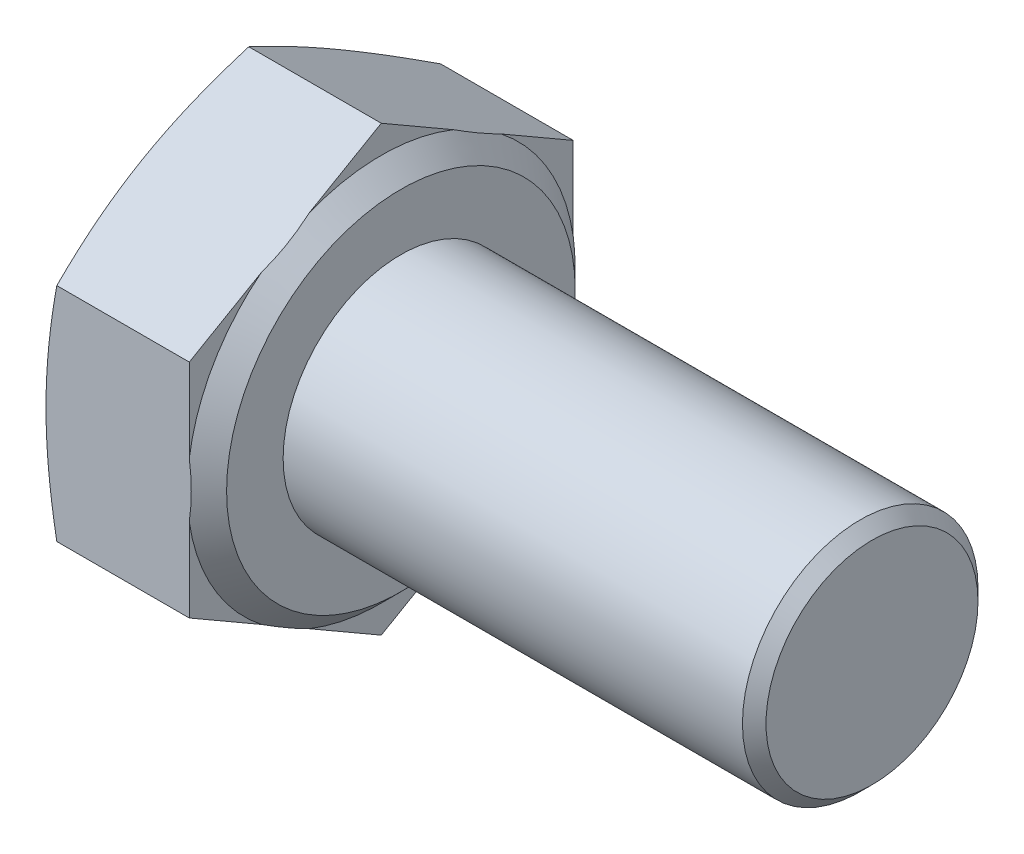
ISO-10303-21;
HEADER;
FILE_DESCRIPTION(('STEP AP214'),'2;1');
FILE_NAME('part.step','',(''),(''),'','','');
FILE_SCHEMA(('AUTOMOTIVE_DESIGN { 1 0 10303 214 1 1 1 1 }'));
ENDSEC;
DATA;
#1=APPLICATION_CONTEXT('core data for automotive mechanical design processes');
#2=APPLICATION_PROTOCOL_DEFINITION('international standard','automotive_design',2000,#1);
#3=PRODUCT_CONTEXT('',#1,'mechanical');
#4=PRODUCT('Part','Part','',(#3));
#5=PRODUCT_RELATED_PRODUCT_CATEGORY('part','',(#4));
#6=PRODUCT_DEFINITION_FORMATION('','',#4);
#7=PRODUCT_DEFINITION_CONTEXT('part definition',#1,'design');
#8=PRODUCT_DEFINITION('design','',#6,#7);
#9=PRODUCT_DEFINITION_SHAPE('','',#8);
#10=(LENGTH_UNIT() NAMED_UNIT(*) SI_UNIT(.MILLI.,.METRE.));
#11=(NAMED_UNIT(*) PLANE_ANGLE_UNIT() SI_UNIT($,.RADIAN.));
#12=(NAMED_UNIT(*) SI_UNIT($,.STERADIAN.) SOLID_ANGLE_UNIT());
#13=UNCERTAINTY_MEASURE_WITH_UNIT(LENGTH_MEASURE(1.E-05),#10,'distance_accuracy_value','');
#14=(GEOMETRIC_REPRESENTATION_CONTEXT(3) GLOBAL_UNCERTAINTY_ASSIGNED_CONTEXT((#13)) GLOBAL_UNIT_ASSIGNED_CONTEXT((#10,
#11,#12)) REPRESENTATION_CONTEXT('',''));
#15=CARTESIAN_POINT('',(0.,0.,0.));
#16=DIRECTION('',(0.,0.,1.));
#17=DIRECTION('',(1.,0.,0.));
#18=AXIS2_PLACEMENT_3D('',#15,#16,#17);
#19=CARTESIAN_POINT('',(4.15,-8.46972844901181,4.89));
#20=DIRECTION('',(-1.,0.,0.));
#21=DIRECTION('',(0.,0.,1.));
#22=AXIS2_PLACEMENT_3D('',#19,#20,#21);
#23=PLANE('',#22);
#24=CARTESIAN_POINT('',(4.15,0.,0.));
#25=DIRECTION('',(-1.,0.,0.));
#26=DIRECTION('',(0.,0.,1.));
#27=AXIS2_PLACEMENT_3D('',#24,#25,#26);
#28=CIRCLE('',#27,4.44);
#29=CARTESIAN_POINT('',(4.15,0.,4.44));
#30=VERTEX_POINT('',#29);
#31=EDGE_CURVE('E507',#30,#30,#28,.T.);
#32=ORIENTED_EDGE('',*,*,#31,.F.);
#33=EDGE_LOOP('',(#32));
#34=FACE_BOUND('',#33,.T.);
#35=CARTESIAN_POINT('',(4.15,0.,0.));
#36=DIRECTION('',(-1.,0.,0.));
#37=DIRECTION('',(0.,0.,1.));
#38=AXIS2_PLACEMENT_3D('',#35,#36,#37);
#39=CIRCLE('',#38,3.);
#40=CARTESIAN_POINT('',(4.15,0.,3.));
#41=VERTEX_POINT('',#40);
#42=EDGE_CURVE('E190',#41,#41,#39,.F.);
#43=ORIENTED_EDGE('',*,*,#42,.F.);
#44=EDGE_LOOP('',(#43));
#45=FACE_BOUND('',#44,.T.);
#46=ADVANCED_FACE('F37',(#34,#45),#23,.F.);
#47=CARTESIAN_POINT('',(4.15,-5.64648563267454,0.));
#48=DIRECTION('',(0.,0.866025403784439,0.5));
#49=DIRECTION('',(0.,-0.5,0.866025403784439));
#50=AXIS2_PLACEMENT_3D('',#47,#48,#49);
#51=PLANE('',#50);
#52=CARTESIAN_POINT('',(0.275380281895275,-2.82312734628344,-4.8902));
#53=CARTESIAN_POINT('',(0.232806027313739,-2.94005354571479,-4.68767788184897));
#54=CARTESIAN_POINT('',(0.194077322500995,-3.05736532610898,-4.48448791787986));
#55=CARTESIAN_POINT('',(0.125940094634839,-3.29275168688454,-4.07678678160786));
#56=CARTESIAN_POINT('',(0.0965388652659339,-3.4108267909009,-3.87227470234254));
#57=CARTESIAN_POINT('',(0.0489831961065203,-3.64642938860636,-3.46419903272147));
#58=CARTESIAN_POINT('',(0.0307250265266,-3.76395150127031,-3.26064476257468));
#59=CARTESIAN_POINT('',(0.0062356835414141,-3.99927056390381,-2.85306019010397));
#60=CARTESIAN_POINT('',(0.,-4.11706739420486,-2.64903009505199));
#61=CARTESIAN_POINT('',(0.,-4.35266105480696,-2.24096990494801));
#62=CARTESIAN_POINT('',(0.0062356835414142,-4.47045788510801,-2.03693980989603));
#63=CARTESIAN_POINT('',(0.0307250265266002,-4.70577694774151,-1.62935523742532));
#64=CARTESIAN_POINT('',(0.0489831961065208,-4.82329906040546,-1.42580096727852));
#65=CARTESIAN_POINT('',(0.0965388652659345,-5.05890165811091,-1.01772529765746));
#66=CARTESIAN_POINT('',(0.12594009463484,-5.17697676212728,-0.81321321839214));
#67=CARTESIAN_POINT('',(0.194077322500995,-5.41236312290283,-0.40551208212014));
#68=CARTESIAN_POINT('',(0.232806027313739,-5.52967490329703,-0.202322118151032));
#69=CARTESIAN_POINT('',(0.275380281895276,-5.64660110272838,0.000200000000001797));
#70=B_SPLINE_CURVE_WITH_KNOTS('',3,(#52,#53,#54,#55,#56,#57,#58,#59,#60,#61,#62,#63,#64,#65,#66,
#67,#68,#69),.UNSPECIFIED.,.F.,.F.,(4,2,2,2,2,2,2,2,4),(0.,0.713162340175091,1.42688097587953,
2.13385008160519,2.84055392207798,3.54725776255078,4.25422686827643,4.96794550398088,
5.68110784415597),.UNSPECIFIED.);
#71=CARTESIAN_POINT('',(0.275338252943565,-2.82324281633728,-4.89));
#72=VERTEX_POINT('',#71);
#73=CARTESIAN_POINT('',(0.,-4.2348642245059,-2.445));
#74=VERTEX_POINT('',#73);
#75=EDGE_CURVE('E152',#72,#74,#70,.T.);
#76=ORIENTED_EDGE('',*,*,#75,.F.);
#77=DIRECTION('',(-1.,0.,0.));
#78=VECTOR('',#77,1.);
#79=CARTESIAN_POINT('',(4.15,-2.82324281633727,-4.89));
#80=LINE('',#79,#78);
#81=CARTESIAN_POINT('',(3.65,-2.82324281633728,-4.89));
#82=VERTEX_POINT('',#81);
#83=EDGE_CURVE('E181',#82,#72,#80,.T.);
#84=ORIENTED_EDGE('',*,*,#83,.F.);
#85=DIRECTION('',(0.,0.5,-0.866025403784439));
#86=VECTOR('',#85,1.);
#87=CARTESIAN_POINT('',(3.65,-5.64648563267454,0.));
#88=LINE('',#87,#86);
#89=CARTESIAN_POINT('',(3.65,-3.88432891957927,-3.05214495797958));
#90=VERTEX_POINT('',#89);
#91=EDGE_CURVE('E311',#90,#82,#88,.T.);
#92=ORIENTED_EDGE('',*,*,#91,.F.);
#93=CARTESIAN_POINT('',(3.6498,-4.58610347345171,-1.83663577521354));
#94=CARTESIAN_POINT('',(3.66642630233643,-4.52781095860012,-1.93760137263744));
#95=CARTESIAN_POINT('',(3.67899788281248,-4.46922077375916,-2.03908254960684));
#96=CARTESIAN_POINT('',(3.69576369124272,-4.35204080140414,-2.24204421535525));
#97=CARTESIAN_POINT('',(3.7000000000002,-4.29345251295301,-2.34352210768111));
#98=CARTESIAN_POINT('',(3.69999999999981,-4.17627593605075,-2.54647789233283));
#99=CARTESIAN_POINT('',(3.69576369124194,-4.11768764759962,-2.64795578465868));
#100=CARTESIAN_POINT('',(3.67899788281095,-4.00050767524463,-2.85091745040704));
#101=CARTESIAN_POINT('',(3.66642630233452,-3.94191749040369,-2.9523986273764));
#102=CARTESIAN_POINT('',(3.64979999999773,-3.88362497555213,-3.05336422480026));
#103=B_SPLINE_CURVE_WITH_KNOTS('',3,(#93,#94,#95,#96,#97,#98,#99,#100,#101,#102),.UNSPECIFIED.,
.F.,.F.,(4,2,2,2,4),(0.,0.353249681620497,0.704711351351652,1.05617302108281,1.4094227027033),.UNSPECIFIED.);
#104=CARTESIAN_POINT('',(3.65,-4.58539952943254,-1.83785504202042));
#105=VERTEX_POINT('',#104);
#106=EDGE_CURVE('E298',#105,#90,#103,.T.);
#107=ORIENTED_EDGE('',*,*,#106,.F.);
#108=CARTESIAN_POINT('',(3.65,-5.64648563267454,0.));
#109=VERTEX_POINT('',#108);
#110=EDGE_CURVE('E308',#109,#105,#88,.T.);
#111=ORIENTED_EDGE('',*,*,#110,.F.);
#112=DIRECTION('',(-1.,0.,0.));
#113=VECTOR('',#112,1.);
#114=CARTESIAN_POINT('',(4.15,-5.64648563267454,0.));
#115=LINE('',#114,#113);
#116=CARTESIAN_POINT('',(0.275338252943565,-5.64648563267454,0.));
#117=VERTEX_POINT('',#116);
#118=EDGE_CURVE('E175',#109,#117,#115,.T.);
#119=ORIENTED_EDGE('',*,*,#118,.T.);
#120=EDGE_CURVE('E265',#74,#117,#70,.T.);
#121=ORIENTED_EDGE('',*,*,#120,.F.);
#122=EDGE_LOOP('',(#76,#84,#92,#107,#111,#119,#121));
#123=FACE_BOUND('',#122,.T.);
#124=ADVANCED_FACE('F206',(#123),#51,.F.);
#125=CARTESIAN_POINT('',(4.15,-2.82324281633727,-4.89));
#126=DIRECTION('',(0.,0.,1.));
#127=DIRECTION('',(0.,-1.,0.));
#128=AXIS2_PLACEMENT_3D('',#125,#126,#127);
#129=PLANE('',#128);
#130=CARTESIAN_POINT('',(1.47129843051555,-7.47495425724797,-4.89));
#131=CARTESIAN_POINT('',(1.40393054332345,-7.25371297327245,-4.89));
#132=CARTESIAN_POINT('',(1.33734875170117,-7.03222787331575,-4.89));
#133=CARTESIAN_POINT('',(1.20619222642614,-6.5886459132952,-4.89));
#134=CARTESIAN_POINT('',(1.14161765159282,-6.36654900632853,-4.89));
#135=CARTESIAN_POINT('',(1.01480300753387,-5.92123916149789,-4.89));
#136=CARTESIAN_POINT('',(0.952567518699377,-5.69802491452354,-4.89));
#137=CARTESIAN_POINT('',(0.831159654925677,-5.25076608896256,-4.89));
#138=CARTESIAN_POINT('',(0.771987224988546,-5.02672152536191,-4.89));
#139=CARTESIAN_POINT('',(0.658168460903988,-4.58041494423012,-4.89));
#140=CARTESIAN_POINT('',(0.603475404476185,-4.35816490133425,-4.89));
#141=CARTESIAN_POINT('',(0.498748924258514,-3.91257162743953,-4.89));
#142=CARTESIAN_POINT('',(0.448715311444419,-3.68922844117454,-4.89));
#143=CARTESIAN_POINT('',(0.354469251487066,-3.24137981990804,-4.89));
#144=CARTESIAN_POINT('',(0.310254984771775,-3.01687477112188,-4.89));
#145=CARTESIAN_POINT('',(0.228995612914628,-2.56656126632832,-4.89));
#146=CARTESIAN_POINT('',(0.191950267572438,-2.34075285425229,-4.89));
#147=CARTESIAN_POINT('',(0.130201731357066,-1.91325953628955,-4.89));
#148=CARTESIAN_POINT('',(0.104580435079537,-1.71170849142527,-4.89));
#149=CARTESIAN_POINT('',(0.0612096842313696,-1.30775414391415,-4.89));
#150=CARTESIAN_POINT('',(0.0434600002738132,-1.10535086627579,-4.89));
#151=CARTESIAN_POINT('',(0.0166872625123729,-0.700102601701754,-4.89));
#152=CARTESIAN_POINT('',(0.00765803623114298,-0.497258029198199,-4.89));
#153=CARTESIAN_POINT('',(-0.00121663811733569,-0.0913659426418282,-4.89));
#154=CARTESIAN_POINT('',(-0.00106215103967763,0.111681569967704,-4.89));
#155=CARTESIAN_POINT('',(0.00844625795837129,0.518587824423097,-4.89));
#156=CARTESIAN_POINT('',(0.0178468309147348,0.722445458002955,-4.89));
#157=CARTESIAN_POINT('',(0.0454147970903177,1.12956194383815,-4.89));
#158=CARTESIAN_POINT('',(0.0635824009316979,1.33282078158978,-4.89));
#159=CARTESIAN_POINT('',(0.107834549289372,1.73863931262525,-4.89));
#160=CARTESIAN_POINT('',(0.133925893808018,1.94119825366685,-4.89));
#161=CARTESIAN_POINT('',(0.192967216980313,2.34530277401886,-4.89));
#162=CARTESIAN_POINT('',(0.225917232394029,2.54684834789205,-4.89));
#163=CARTESIAN_POINT('',(0.299499517650744,2.95953215010376,-4.89));
#164=CARTESIAN_POINT('',(0.340445956688628,3.17061386300071,-4.89));
#165=CARTESIAN_POINT('',(0.427609249291963,3.59169320933632,-4.89));
#166=CARTESIAN_POINT('',(0.473826500199634,3.80169075979599,-4.89));
#167=CARTESIAN_POINT('',(0.570557900999629,4.22074597294804,-4.89));
#168=CARTESIAN_POINT('',(0.621073175595286,4.42980337446155,-4.89));
#169=CARTESIAN_POINT('',(0.725589260740134,4.84704782482265,-4.89));
#170=CARTESIAN_POINT('',(0.779590188749264,5.05523484408803,-4.89));
#171=CARTESIAN_POINT('',(0.945945123104759,5.67918655017082,-4.89));
#172=CARTESIAN_POINT('',(1.06252765165215,6.09382208771138,-4.89));
#173=CARTESIAN_POINT('',(1.30317591067348,6.92081542462389,-4.89));
#174=CARTESIAN_POINT('',(1.42724045379556,7.33317357412567,-4.89));
#175=CARTESIAN_POINT('',(1.67916430203802,8.15174363231448,-4.89));
#176=CARTESIAN_POINT('',(1.80696660584998,8.5579731429888,-4.89));
#177=CARTESIAN_POINT('',(2.06620027272763,9.3692896726391,-4.89));
#178=CARTESIAN_POINT('',(2.197631809911,9.77437663576853,-4.89));
#179=CARTESIAN_POINT('',(2.46263754077596,10.5821449084831,-4.89));
#180=CARTESIAN_POINT('',(2.59620171226703,10.9848295138919,-4.89));
#181=CARTESIAN_POINT('',(2.86533263635875,11.7894926507764,-4.89));
#182=CARTESIAN_POINT('',(3.0008992231112,12.1914712376759,-4.89));
#183=CARTESIAN_POINT('',(3.13716622035366,12.5932087593599,-4.89));
#184=B_SPLINE_CURVE_WITH_KNOTS('',3,(#130,#131,#132,#133,#134,#135,#136,#137,#138,#139,#140,
#141,#142,#143,#144,#145,#146,#147,#148,#149,#150,#151,#152,#153,#154,#155,#156,#157,#158,#159,
#160,#161,#162,#163,#164,#165,#166,#167,#168,#169,#170,#171,#172,#173,#174,#175,#176,#177,#178,
#179,#180,#181,#182,#183),.UNSPECIFIED.,.F.,.F.,(4,2,2,2,2,2,2,2,2,2,2,2,2,2,2,2,2,2,2,2,2,2,2,
2,2,2,4),(0.,0.693817023561641,1.38768880581803,2.08285517981212,2.7780090676014,
3.46461177035686,4.15118660688119,4.83754625508125,5.52388290227977,6.1332681361085,
6.74263561065466,7.35157144850729,7.9605029860748,8.57252272493959,9.18455716790883,
9.79711833848643,10.4096827922613,11.054649801825,11.6996654646589,12.3448504368587,
12.9900571619358,14.2820728837525,15.5738841070477,16.8514365120942,18.1290503164153,
19.4018164190377,20.6744776905923),.UNSPECIFIED.);
#185=CARTESIAN_POINT('',(0.275338252943565,2.82324281633727,-4.89000000000001));
#186=VERTEX_POINT('',#185);
#187=CARTESIAN_POINT('',(0.,0.,-4.89));
#188=VERTEX_POINT('',#187);
#189=EDGE_CURVE('E277',#186,#188,#184,.F.);
#190=ORIENTED_EDGE('',*,*,#189,.F.);
#191=DIRECTION('',(-1.,0.,0.));
#192=VECTOR('',#191,1.);
#193=CARTESIAN_POINT('',(4.15,2.82324281633727,-4.89));
#194=LINE('',#193,#192);
#195=CARTESIAN_POINT('',(3.65,2.82324281633727,-4.89));
#196=VERTEX_POINT('',#195);
#197=EDGE_CURVE('E172',#196,#186,#194,.T.);
#198=ORIENTED_EDGE('',*,*,#197,.F.);
#199=DIRECTION('',(0.,1.,0.));
#200=VECTOR('',#199,1.);
#201=CARTESIAN_POINT('',(3.65,-2.82324281633727,-4.89));
#202=LINE('',#201,#200);
#203=CARTESIAN_POINT('',(3.65,0.701070609853285,-4.89));
#204=VERTEX_POINT('',#203);
#205=EDGE_CURVE('E319',#204,#196,#202,.T.);
#206=ORIENTED_EDGE('',*,*,#205,.F.);
#207=CARTESIAN_POINT('',(3.03451610167313,-2.63653206780597,-4.89));
#208=CARTESIAN_POINT('',(3.10849067572388,-2.48058820797332,-4.89));
#209=CARTESIAN_POINT('',(3.17843227251853,-2.3225658150431,-4.89));
#210=CARTESIAN_POINT('',(3.30815593937757,-2.00185975303429,-4.89));
#211=CARTESIAN_POINT('',(3.36790591157042,-1.83916317651322,-4.89));
#212=CARTESIAN_POINT('',(3.47430176536649,-1.51069530968842,-4.89));
#213=CARTESIAN_POINT('',(3.52103440039963,-1.34495262643883,-4.89));
#214=CARTESIAN_POINT('',(3.59941295927054,-1.01008442397129,-4.89));
#215=CARTESIAN_POINT('',(3.63107835052522,-0.840963565645152,-4.89));
#216=CARTESIAN_POINT('',(3.67067369985504,-0.549624485933596,-4.89));
#217=CARTESIAN_POINT('',(3.68281796567514,-0.427971801597366,-4.89));
#218=CARTESIAN_POINT('',(3.6980494521618,-0.184073425551841,-4.89));
#219=CARTESIAN_POINT('',(3.70113559934876,-0.0618276652763858,-4.89));
#220=CARTESIAN_POINT('',(3.69811824393208,0.182639197761046,-4.89));
#221=CARTESIAN_POINT('',(3.69200798941262,0.304860216451617,-4.89));
#222=CARTESIAN_POINT('',(3.67083296686346,0.54849298500484,-4.89));
#223=CARTESIAN_POINT('',(3.65576928102,0.669904830877755,-4.89));
#224=CARTESIAN_POINT('',(3.60751278659157,0.972186481066576,-4.89));
#225=CARTESIAN_POINT('',(3.56901104925984,1.15221939847223,-4.89));
#226=CARTESIAN_POINT('',(3.47560353419222,1.50816362351894,-4.89));
#227=CARTESIAN_POINT('',(3.42067264113039,1.68406817287318,-4.89));
#228=CARTESIAN_POINT('',(3.29720232108195,2.0317979906774,-4.89));
#229=CARTESIAN_POINT('',(3.22860539819505,2.20360246792536,-4.89));
#230=CARTESIAN_POINT('',(3.08087349193912,2.54190390921175,-4.89));
#231=CARTESIAN_POINT('',(3.00177775794251,2.7084179096231,-4.89));
#232=CARTESIAN_POINT('',(2.91862888345722,2.8726904360818,-4.89));
#233=B_SPLINE_CURVE_WITH_KNOTS('',3,(#207,#208,#209,#210,#211,#212,#213,#214,#215,#216,#217,
#218,#219,#220,#221,#222,#223,#224,#225,#226,#227,#228,#229,#230,#231,#232),.UNSPECIFIED.,.F.,
.F.,(4,2,2,2,2,2,2,2,2,2,2,2,4),(0.,0.517967526591367,1.03753738829618,1.55355690657567,
2.06890788657605,2.43537052902186,2.80187659928168,3.16865188631198,3.53538285084041,
4.08673119441343,4.63892673258675,5.19349649620659,5.74604853278358),.UNSPECIFIED.);
#234=CARTESIAN_POINT('',(3.65,-0.701070609853286,-4.89));
#235=VERTEX_POINT('',#234);
#236=EDGE_CURVE('E292',#235,#204,#233,.T.);
#237=ORIENTED_EDGE('',*,*,#236,.F.);
#238=EDGE_CURVE('E320',#82,#235,#202,.T.);
#239=ORIENTED_EDGE('',*,*,#238,.F.);
#240=ORIENTED_EDGE('',*,*,#83,.T.);
#241=EDGE_CURVE('E163',#188,#72,#184,.F.);
#242=ORIENTED_EDGE('',*,*,#241,.F.);
#243=EDGE_LOOP('',(#190,#198,#206,#237,#239,#240,#242));
#244=FACE_BOUND('',#243,.T.);
#245=ADVANCED_FACE('F212',(#244),#129,.F.);
#246=CARTESIAN_POINT('',(4.15,2.82324281633727,-4.89));
#247=DIRECTION('',(0.,-0.866025403784438,0.5));
#248=DIRECTION('',(0.,-0.5,-0.866025403784439));
#249=AXIS2_PLACEMENT_3D('',#246,#247,#248);
#250=PLANE('',#249);
#251=CARTESIAN_POINT('',(0.275380281895276,5.64660110272838,0.00020000000000078));
#252=CARTESIAN_POINT('',(0.232806027313739,5.52967490329703,-0.202322118151033));
#253=CARTESIAN_POINT('',(0.194077322500995,5.41236312290283,-0.405512082120141));
#254=CARTESIAN_POINT('',(0.12594009463484,5.17697676212728,-0.81321321839214));
#255=CARTESIAN_POINT('',(0.0965388652659348,5.05890165811092,-1.01772529765746));
#256=CARTESIAN_POINT('',(0.0489831961065211,4.82329906040546,-1.42580096727853));
#257=CARTESIAN_POINT('',(0.0307250265266006,4.70577694774151,-1.62935523742532));
#258=CARTESIAN_POINT('',(0.00623568354141463,4.47045788510801,-2.03693980989603));
#259=CARTESIAN_POINT('',(0.,4.35266105480696,-2.24096990494801));
#260=CARTESIAN_POINT('',(0.,4.11706739420486,-2.64903009505199));
#261=CARTESIAN_POINT('',(0.0062356835414144,3.99927056390381,-2.85306019010397));
#262=CARTESIAN_POINT('',(0.0307250265266003,3.76395150127031,-3.26064476257468));
#263=CARTESIAN_POINT('',(0.048983196106521,3.64642938860636,-3.46419903272147));
#264=CARTESIAN_POINT('',(0.0965388652659346,3.4108267909009,-3.87227470234254));
#265=CARTESIAN_POINT('',(0.12594009463484,3.29275168688454,-4.07678678160786));
#266=CARTESIAN_POINT('',(0.194077322500995,3.05736532610898,-4.48448791787986));
#267=CARTESIAN_POINT('',(0.232806027313739,2.94005354571479,-4.68767788184897));
#268=CARTESIAN_POINT('',(0.275380281895275,2.82312734628343,-4.8902));
#269=B_SPLINE_CURVE_WITH_KNOTS('',3,(#251,#252,#253,#254,#255,#256,#257,#258,#259,#260,#261,
#262,#263,#264,#265,#266,#267,#268),.UNSPECIFIED.,.F.,.F.,(4,2,2,2,2,2,2,2,4),(0.,
0.713162340175091,1.42688097587953,2.13385008160519,2.84055392207798,3.54725776255078,
4.25422686827643,4.96794550398088,5.68110784415597),.UNSPECIFIED.);
#270=CARTESIAN_POINT('',(0.275338252943565,5.64648563267454,0.));
#271=VERTEX_POINT('',#270);
#272=CARTESIAN_POINT('',(0.,4.2348642245059,-2.445));
#273=VERTEX_POINT('',#272);
#274=EDGE_CURVE('E515',#271,#273,#269,.T.);
#275=ORIENTED_EDGE('',*,*,#274,.F.);
#276=DIRECTION('',(-1.,0.,0.));
#277=VECTOR('',#276,1.);
#278=CARTESIAN_POINT('',(4.15,5.64648563267454,0.));
#279=LINE('',#278,#277);
#280=CARTESIAN_POINT('',(3.65,5.64648563267454,0.));
#281=VERTEX_POINT('',#280);
#282=EDGE_CURVE('E169',#281,#271,#279,.T.);
#283=ORIENTED_EDGE('',*,*,#282,.F.);
#284=DIRECTION('',(0.,0.5,0.866025403784439));
#285=VECTOR('',#284,1.);
#286=CARTESIAN_POINT('',(3.65,2.82324281633727,-4.89));
#287=LINE('',#286,#285);
#288=CARTESIAN_POINT('',(3.65,4.58539952943254,-1.83785504202042));
#289=VERTEX_POINT('',#288);
#290=EDGE_CURVE('E316',#289,#281,#287,.T.);
#291=ORIENTED_EDGE('',*,*,#290,.F.);
#292=CARTESIAN_POINT('',(3.64979999999773,3.88362497555214,-3.05336422480026));
#293=CARTESIAN_POINT('',(3.66642630233452,3.9419174904037,-2.9523986273764));
#294=CARTESIAN_POINT('',(3.67899788281095,4.00050767524464,-2.85091745040704));
#295=CARTESIAN_POINT('',(3.69576369124194,4.11768764759963,-2.64795578465868));
#296=CARTESIAN_POINT('',(3.69999999999981,4.17627593605075,-2.54647789233283));
#297=CARTESIAN_POINT('',(3.7000000000002,4.29345251295301,-2.34352210768112));
#298=CARTESIAN_POINT('',(3.69576369124271,4.35204080140414,-2.24204421535525));
#299=CARTESIAN_POINT('',(3.67899788281248,4.46922077375916,-2.03908254960684));
#300=CARTESIAN_POINT('',(3.66642630233643,4.52781095860012,-1.93760137263745));
#301=CARTESIAN_POINT('',(3.6498,4.58610347345171,-1.83663577521354));
#302=B_SPLINE_CURVE_WITH_KNOTS('',3,(#292,#293,#294,#295,#296,#297,#298,#299,#300,#301),
.UNSPECIFIED.,.F.,.F.,(4,2,2,2,4),(0.,0.353249681620493,0.704711351351643,1.05617302108279,
1.40942270270329),.UNSPECIFIED.);
#303=CARTESIAN_POINT('',(3.65,3.88432891957927,-3.05214495797958));
#304=VERTEX_POINT('',#303);
#305=EDGE_CURVE('E299',#304,#289,#302,.T.);
#306=ORIENTED_EDGE('',*,*,#305,.F.);
#307=EDGE_CURVE('E318',#196,#304,#287,.T.);
#308=ORIENTED_EDGE('',*,*,#307,.F.);
#309=ORIENTED_EDGE('',*,*,#197,.T.);
#310=EDGE_CURVE('E278',#273,#186,#269,.T.);
#311=ORIENTED_EDGE('',*,*,#310,.F.);
#312=EDGE_LOOP('',(#275,#283,#291,#306,#308,#309,#311));
#313=FACE_BOUND('',#312,.T.);
#314=ADVANCED_FACE('F286',(#313),#250,.F.);
#315=CARTESIAN_POINT('',(4.15,5.64648563267454,0.));
#316=DIRECTION('',(0.,-0.866025403784439,-0.5));
#317=DIRECTION('',(0.,0.5,-0.866025403784439));
#318=AXIS2_PLACEMENT_3D('',#315,#316,#317);
#319=PLANE('',#318);
#320=CARTESIAN_POINT('',(0.275380281895276,2.82312734628343,4.8902));
#321=CARTESIAN_POINT('',(0.23280602731374,2.94005354571479,4.68767788184897));
#322=CARTESIAN_POINT('',(0.194077322500996,3.05736532610898,4.48448791787986));
#323=CARTESIAN_POINT('',(0.12594009463484,3.29275168688454,4.07678678160786));
#324=CARTESIAN_POINT('',(0.0965388652659352,3.4108267909009,3.87227470234254));
#325=CARTESIAN_POINT('',(0.0489831961065216,3.64642938860636,3.46419903272147));
#326=CARTESIAN_POINT('',(0.030725026526601,3.76395150127031,3.26064476257468));
#327=CARTESIAN_POINT('',(0.00623568354141499,3.99927056390381,2.85306019010397));
#328=CARTESIAN_POINT('',(0.,4.11706739420486,2.64903009505199));
#329=CARTESIAN_POINT('',(0.,4.35266105480696,2.24096990494801));
#330=CARTESIAN_POINT('',(0.00623568354141504,4.47045788510801,2.03693980989603));
#331=CARTESIAN_POINT('',(0.0307250265266012,4.70577694774151,1.62935523742532));
#332=CARTESIAN_POINT('',(0.0489831961065218,4.82329906040546,1.42580096727853));
#333=CARTESIAN_POINT('',(0.0965388652659355,5.05890165811092,1.01772529765746));
#334=CARTESIAN_POINT('',(0.125940094634841,5.17697676212728,0.813213218392141));
#335=CARTESIAN_POINT('',(0.194077322500996,5.41236312290283,0.405512082120141));
#336=CARTESIAN_POINT('',(0.23280602731374,5.52967490329703,0.202322118151033));
#337=CARTESIAN_POINT('',(0.275380281895277,5.64660110272838,-0.000200000000000697));
#338=B_SPLINE_CURVE_WITH_KNOTS('',3,(#320,#321,#322,#323,#324,#325,#326,#327,#328,#329,#330,
#331,#332,#333,#334,#335,#336,#337),.UNSPECIFIED.,.F.,.F.,(4,2,2,2,2,2,2,2,4),(0.,
0.713162340175092,1.42688097587953,2.13385008160519,2.84055392207798,3.54725776255078,
4.25422686827643,4.96794550398088,5.68110784415597),.UNSPECIFIED.);
#339=CARTESIAN_POINT('',(0.275338252943565,2.82324281633728,4.89));
#340=VERTEX_POINT('',#339);
#341=CARTESIAN_POINT('',(0.,4.2348642245059,2.445));
#342=VERTEX_POINT('',#341);
#343=EDGE_CURVE('E147',#340,#342,#338,.T.);
#344=ORIENTED_EDGE('',*,*,#343,.F.);
#345=DIRECTION('',(-1.,0.,0.));
#346=VECTOR('',#345,1.);
#347=CARTESIAN_POINT('',(4.15,2.82324281633727,4.89));
#348=LINE('',#347,#346);
#349=CARTESIAN_POINT('',(3.65,2.82324281633727,4.89));
#350=VERTEX_POINT('',#349);
#351=EDGE_CURVE('E160',#350,#340,#348,.T.);
#352=ORIENTED_EDGE('',*,*,#351,.F.);
#353=DIRECTION('',(0.,-0.5,0.866025403784439));
#354=VECTOR('',#353,1.);
#355=CARTESIAN_POINT('',(3.65,5.64648563267454,0.));
#356=LINE('',#355,#354);
#357=CARTESIAN_POINT('',(3.65,3.88432891957928,3.05214495797957));
#358=VERTEX_POINT('',#357);
#359=EDGE_CURVE('E313',#358,#350,#356,.T.);
#360=ORIENTED_EDGE('',*,*,#359,.F.);
#361=CARTESIAN_POINT('',(3.6498,4.5861034734517,1.83663577521355));
#362=CARTESIAN_POINT('',(3.66642630233632,4.52781095860049,1.93760137263682));
#363=CARTESIAN_POINT('',(3.67899788281232,4.4692207737599,2.03908254960558));
#364=CARTESIAN_POINT('',(3.69576369124255,4.35204080140561,2.24204421535271));
#365=CARTESIAN_POINT('',(3.70000000000009,4.29345251295485,2.34352210767794));
#366=CARTESIAN_POINT('',(3.69999999999991,4.17627593605332,2.54647789232839));
#367=CARTESIAN_POINT('',(3.6957636912422,4.11768764760256,2.64795578465361));
#368=CARTESIAN_POINT('',(3.67899788281163,4.00050767524829,2.85091745040072));
#369=CARTESIAN_POINT('',(3.66642630233546,3.94191749040771,2.95239862736946));
#370=CARTESIAN_POINT('',(3.64979999999897,3.8836249755565,3.05336422479271));
#371=B_SPLINE_CURVE_WITH_KNOTS('',3,(#361,#362,#363,#364,#365,#366,#367,#368,#369,#370),
.UNSPECIFIED.,.F.,.F.,(4,2,2,2,4),(0.,0.353249681618275,0.70471135134724,1.0561730210762,
1.40942270269448),.UNSPECIFIED.);
#372=CARTESIAN_POINT('',(3.65,4.58539952943254,1.83785504202043));
#373=VERTEX_POINT('',#372);
#374=EDGE_CURVE('E354',#373,#358,#371,.T.);
#375=ORIENTED_EDGE('',*,*,#374,.F.);
#376=EDGE_CURVE('E315',#281,#373,#356,.T.);
#377=ORIENTED_EDGE('',*,*,#376,.F.);
#378=ORIENTED_EDGE('',*,*,#282,.T.);
#379=EDGE_CURVE('E162',#342,#271,#338,.T.);
#380=ORIENTED_EDGE('',*,*,#379,.F.);
#381=EDGE_LOOP('',(#344,#352,#360,#375,#377,#378,#380));
#382=FACE_BOUND('',#381,.T.);
#383=ADVANCED_FACE('F158',(#382),#319,.F.);
#384=CARTESIAN_POINT('',(4.15,2.82324281633727,4.89));
#385=DIRECTION('',(0.,0.,-1.));
#386=DIRECTION('',(0.,1.,0.));
#387=AXIS2_PLACEMENT_3D('',#384,#385,#386);
#388=PLANE('',#387);
#389=CARTESIAN_POINT('',(1.47129843051555,-7.47495425724796,4.89));
#390=CARTESIAN_POINT('',(1.40393054332345,-7.25371297327245,4.89));
#391=CARTESIAN_POINT('',(1.33734875170117,-7.03222787331575,4.89));
#392=CARTESIAN_POINT('',(1.20619222642614,-6.5886459132952,4.89));
#393=CARTESIAN_POINT('',(1.14161765159282,-6.36654900632852,4.89));
#394=CARTESIAN_POINT('',(1.01480300753387,-5.92123916149788,4.89));
#395=CARTESIAN_POINT('',(0.952567518699377,-5.69802491452353,4.89));
#396=CARTESIAN_POINT('',(0.831159654925676,-5.25076608896255,4.89));
#397=CARTESIAN_POINT('',(0.771987224988545,-5.0267215253619,4.89));
#398=CARTESIAN_POINT('',(0.658168460903987,-4.58041494423011,4.89));
#399=CARTESIAN_POINT('',(0.603475404476185,-4.35816490133425,4.89));
#400=CARTESIAN_POINT('',(0.498748924258514,-3.91257162743952,4.89));
#401=CARTESIAN_POINT('',(0.448715311444419,-3.68922844117453,4.89));
#402=CARTESIAN_POINT('',(0.354469251487066,-3.24137981990804,4.89));
#403=CARTESIAN_POINT('',(0.310254984771776,-3.01687477112187,4.89));
#404=CARTESIAN_POINT('',(0.228995612914629,-2.56656126632831,4.89));
#405=CARTESIAN_POINT('',(0.191950267572439,-2.34075285425229,4.89));
#406=CARTESIAN_POINT('',(0.130201731357066,-1.91325953628954,4.89));
#407=CARTESIAN_POINT('',(0.104580435079537,-1.71170849142527,4.89));
#408=CARTESIAN_POINT('',(0.0612096842313704,-1.30775414391415,4.89));
#409=CARTESIAN_POINT('',(0.0434600002738141,-1.10535086627579,4.89));
#410=CARTESIAN_POINT('',(0.0166872625123739,-0.700102601701752,4.89));
#411=CARTESIAN_POINT('',(0.00765803623114397,-0.497258029198196,4.89));
#412=CARTESIAN_POINT('',(-0.00121663811733478,-0.0913659426418263,4.89));
#413=CARTESIAN_POINT('',(-0.00106215103967677,0.111681569967706,4.89));
#414=CARTESIAN_POINT('',(0.00844625795837234,0.518587824423099,4.89));
#415=CARTESIAN_POINT('',(0.017846830914736,0.722445458002957,4.89));
#416=CARTESIAN_POINT('',(0.045414797090319,1.12956194383816,4.89));
#417=CARTESIAN_POINT('',(0.063582400931699,1.33282078158978,4.89));
#418=CARTESIAN_POINT('',(0.107834549289373,1.73863931262526,4.89));
#419=CARTESIAN_POINT('',(0.13392589380802,1.94119825366685,4.89));
#420=CARTESIAN_POINT('',(0.192967216980315,2.34530277401886,4.89));
#421=CARTESIAN_POINT('',(0.22591723239403,2.54684834789205,4.89));
#422=CARTESIAN_POINT('',(0.299499517650745,2.95953215010376,4.89));
#423=CARTESIAN_POINT('',(0.340445956688629,3.17061386300071,4.89));
#424=CARTESIAN_POINT('',(0.427609249291965,3.59169320933632,4.89));
#425=CARTESIAN_POINT('',(0.473826500199635,3.80169075979599,4.89));
#426=CARTESIAN_POINT('',(0.57055790099963,4.22074597294805,4.89));
#427=CARTESIAN_POINT('',(0.621073175595287,4.42980337446155,4.89));
#428=CARTESIAN_POINT('',(0.725589260740135,4.84704782482265,4.89));
#429=CARTESIAN_POINT('',(0.779590188749265,5.05523484408803,4.89));
#430=CARTESIAN_POINT('',(0.945945123104761,5.67918655017082,4.89));
#431=CARTESIAN_POINT('',(1.06252765165216,6.09382208771139,4.89));
#432=CARTESIAN_POINT('',(1.30317591067348,6.92081542462389,4.89));
#433=CARTESIAN_POINT('',(1.42724045379557,7.33317357412568,4.89));
#434=CARTESIAN_POINT('',(1.67916430203802,8.15174363231448,4.89));
#435=CARTESIAN_POINT('',(1.80696660584999,8.55797314298881,4.89));
#436=CARTESIAN_POINT('',(2.06620027272763,9.3692896726391,4.89));
#437=CARTESIAN_POINT('',(2.197631809911,9.77437663576853,4.89));
#438=CARTESIAN_POINT('',(2.46263754077596,10.5821449084831,4.89));
#439=CARTESIAN_POINT('',(2.59620171226703,10.9848295138919,4.89));
#440=CARTESIAN_POINT('',(2.86533263635875,11.7894926507764,4.89));
#441=CARTESIAN_POINT('',(3.0008992231112,12.1914712376759,4.89));
#442=CARTESIAN_POINT('',(3.13716622035365,12.5932087593599,4.89));
#443=B_SPLINE_CURVE_WITH_KNOTS('',3,(#389,#390,#391,#392,#393,#394,#395,#396,#397,#398,#399,
#400,#401,#402,#403,#404,#405,#406,#407,#408,#409,#410,#411,#412,#413,#414,#415,#416,#417,#418,
#419,#420,#421,#422,#423,#424,#425,#426,#427,#428,#429,#430,#431,#432,#433,#434,#435,#436,#437,
#438,#439,#440,#441,#442),.UNSPECIFIED.,.F.,.F.,(4,2,2,2,2,2,2,2,2,2,2,2,2,2,2,2,2,2,2,2,2,2,2,
2,2,2,4),(0.,0.693817023561643,1.38768880581803,2.08285517981212,2.77800906760141,
3.46461177035687,4.15118660688119,4.83754625508125,5.52388290227977,6.1332681361085,
6.74263561065466,7.35157144850729,7.9605029860748,8.57252272493959,9.18455716790883,
9.79711833848643,10.4096827922613,11.054649801825,11.6996654646589,12.3448504368587,
12.9900571619358,14.2820728837525,15.5738841070477,16.8514365120942,18.1290503164153,
19.4018164190377,20.6744776905923),.UNSPECIFIED.);
#444=CARTESIAN_POINT('',(0.275338252943565,-2.82324281633726,4.89000000000001));
#445=VERTEX_POINT('',#444);
#446=CARTESIAN_POINT('',(0.,0.,4.89));
#447=VERTEX_POINT('',#446);
#448=EDGE_CURVE('E154',#445,#447,#443,.T.);
#449=ORIENTED_EDGE('',*,*,#448,.F.);
#450=DIRECTION('',(-1.,0.,0.));
#451=VECTOR('',#450,1.);
#452=CARTESIAN_POINT('',(4.15,-2.82324281633727,4.89));
#453=LINE('',#452,#451);
#454=CARTESIAN_POINT('',(3.65,-2.82324281633727,4.89000000000001));
#455=VERTEX_POINT('',#454);
#456=EDGE_CURVE('E170',#455,#445,#453,.T.);
#457=ORIENTED_EDGE('',*,*,#456,.F.);
#458=DIRECTION('',(0.,-1.,0.));
#459=VECTOR('',#458,1.);
#460=CARTESIAN_POINT('',(3.65,2.82324281633727,4.89));
#461=LINE('',#460,#459);
#462=CARTESIAN_POINT('',(3.65,-0.701070609853274,4.89));
#463=VERTEX_POINT('',#462);
#464=EDGE_CURVE('E310',#463,#455,#461,.T.);
#465=ORIENTED_EDGE('',*,*,#464,.F.);
#466=CARTESIAN_POINT('',(3.03451610167313,-2.63653206780597,4.89));
#467=CARTESIAN_POINT('',(3.10849067572388,-2.48058820797332,4.89));
#468=CARTESIAN_POINT('',(3.17843227251853,-2.3225658150431,4.89));
#469=CARTESIAN_POINT('',(3.30815593937757,-2.00185975303429,4.89));
#470=CARTESIAN_POINT('',(3.36790591157042,-1.83916317651322,4.89));
#471=CARTESIAN_POINT('',(3.47430176536649,-1.51069530968842,4.89));
#472=CARTESIAN_POINT('',(3.52103440039963,-1.34495262643883,4.89));
#473=CARTESIAN_POINT('',(3.59941295927054,-1.01008442397128,4.89));
#474=CARTESIAN_POINT('',(3.63107835052521,-0.84096356564515,4.89));
#475=CARTESIAN_POINT('',(3.67067369985504,-0.549624485933594,4.89));
#476=CARTESIAN_POINT('',(3.68281796567513,-0.427971801597364,4.89));
#477=CARTESIAN_POINT('',(3.69804945216179,-0.184073425551838,4.89));
#478=CARTESIAN_POINT('',(3.70113559934875,-0.0618276652763824,4.89));
#479=CARTESIAN_POINT('',(3.69811824393207,0.182639197761049,4.89));
#480=CARTESIAN_POINT('',(3.69200798941261,0.30486021645162,4.89));
#481=CARTESIAN_POINT('',(3.67083296686345,0.548492985004844,4.89));
#482=CARTESIAN_POINT('',(3.65576928101999,0.669904830877759,4.89));
#483=CARTESIAN_POINT('',(3.60751278659156,0.97218648106658,4.89));
#484=CARTESIAN_POINT('',(3.56901104925984,1.15221939847223,4.89));
#485=CARTESIAN_POINT('',(3.47560353419221,1.50816362351894,4.89));
#486=CARTESIAN_POINT('',(3.42067264113038,1.68406817287319,4.89));
#487=CARTESIAN_POINT('',(3.29720232108195,2.0317979906774,4.89));
#488=CARTESIAN_POINT('',(3.22860539819505,2.20360246792536,4.89));
#489=CARTESIAN_POINT('',(3.08087349193912,2.54190390921176,4.89));
#490=CARTESIAN_POINT('',(3.00177775794251,2.7084179096231,4.89));
#491=CARTESIAN_POINT('',(2.91862888345721,2.87269043608181,4.89));
#492=B_SPLINE_CURVE_WITH_KNOTS('',3,(#466,#467,#468,#469,#470,#471,#472,#473,#474,#475,#476,
#477,#478,#479,#480,#481,#482,#483,#484,#485,#486,#487,#488,#489,#490,#491),.UNSPECIFIED.,.F.,
.F.,(4,2,2,2,2,2,2,2,2,2,2,2,4),(0.,0.517967526591367,1.03753738829618,1.55355690657567,
2.06890788657605,2.43537052902186,2.80187659928168,3.16865188631198,3.53538285084041,
4.08673119441344,4.63892673258675,5.1934964962066,5.74604853278358),.UNSPECIFIED.);
#493=CARTESIAN_POINT('',(3.65,0.701070609853273,4.89));
#494=VERTEX_POINT('',#493);
#495=EDGE_CURVE('E355',#494,#463,#492,.F.);
#496=ORIENTED_EDGE('',*,*,#495,.F.);
#497=EDGE_CURVE('E168',#350,#494,#461,.T.);
#498=ORIENTED_EDGE('',*,*,#497,.F.);
#499=ORIENTED_EDGE('',*,*,#351,.T.);
#500=EDGE_CURVE('E144',#447,#340,#443,.T.);
#501=ORIENTED_EDGE('',*,*,#500,.F.);
#502=EDGE_LOOP('',(#449,#457,#465,#496,#498,#499,#501));
#503=FACE_BOUND('',#502,.T.);
#504=ADVANCED_FACE('F166',(#503),#388,.F.);
#505=CARTESIAN_POINT('',(4.15,-2.82324281633727,4.89));
#506=DIRECTION('',(0.,0.866025403784438,-0.5));
#507=DIRECTION('',(0.,0.5,0.866025403784439));
#508=AXIS2_PLACEMENT_3D('',#505,#506,#507);
#509=PLANE('',#508);
#510=CARTESIAN_POINT('',(0.275380281895275,-5.64660110272838,-0.000199999999999705));
#511=CARTESIAN_POINT('',(0.232806027313739,-5.52967490329703,0.202322118151034));
#512=CARTESIAN_POINT('',(0.194077322500994,-5.41236312290283,0.405512082120142));
#513=CARTESIAN_POINT('',(0.125940094634839,-5.17697676212727,0.813213218392141));
#514=CARTESIAN_POINT('',(0.0965388652659343,-5.05890165811091,1.01772529765746));
#515=CARTESIAN_POINT('',(0.0489831961065207,-4.82329906040545,1.42580096727853));
#516=CARTESIAN_POINT('',(0.0307250265266002,-4.7057769477415,1.62935523742532));
#517=CARTESIAN_POINT('',(0.00623568354141408,-4.470457885108,2.03693980989603));
#518=CARTESIAN_POINT('',(0.,-4.35266105480695,2.24096990494801));
#519=CARTESIAN_POINT('',(0.,-4.11706739420486,2.64903009505199));
#520=CARTESIAN_POINT('',(0.00623568354141411,-3.99927056390381,2.85306019010397));
#521=CARTESIAN_POINT('',(0.0307250265266,-3.76395150127031,3.26064476257468));
#522=CARTESIAN_POINT('',(0.0489831961065204,-3.64642938860636,3.46419903272147));
#523=CARTESIAN_POINT('',(0.0965388652659339,-3.4108267909009,3.87227470234254));
#524=CARTESIAN_POINT('',(0.125940094634839,-3.29275168688453,4.07678678160786));
#525=CARTESIAN_POINT('',(0.194077322500994,-3.05736532610898,4.48448791787986));
#526=CARTESIAN_POINT('',(0.232806027313739,-2.94005354571478,4.68767788184897));
#527=CARTESIAN_POINT('',(0.275380281895275,-2.82312734628343,4.8902));
#528=B_SPLINE_CURVE_WITH_KNOTS('',3,(#510,#511,#512,#513,#514,#515,#516,#517,#518,#519,#520,
#521,#522,#523,#524,#525,#526,#527),.UNSPECIFIED.,.F.,.F.,(4,2,2,2,2,2,2,2,4),(0.,
0.713162340175091,1.42688097587953,2.13385008160519,2.84055392207798,3.54725776255078,
4.25422686827643,4.96794550398088,5.68110784415597),.UNSPECIFIED.);
#529=CARTESIAN_POINT('',(0.,-4.2348642245059,2.445));
#530=VERTEX_POINT('',#529);
#531=EDGE_CURVE('E247',#117,#530,#528,.T.);
#532=ORIENTED_EDGE('',*,*,#531,.F.);
#533=ORIENTED_EDGE('',*,*,#118,.F.);
#534=DIRECTION('',(0.,-0.5,-0.866025403784439));
#535=VECTOR('',#534,1.);
#536=CARTESIAN_POINT('',(3.65,-2.82324281633727,4.89));
#537=LINE('',#536,#535);
#538=CARTESIAN_POINT('',(3.65,-4.58539952943254,1.83785504202042));
#539=VERTEX_POINT('',#538);
#540=EDGE_CURVE('E184',#539,#109,#537,.T.);
#541=ORIENTED_EDGE('',*,*,#540,.F.);
#542=CARTESIAN_POINT('',(3.64979999999897,-3.88362497555649,3.05336422479273));
#543=CARTESIAN_POINT('',(3.66642630233546,-3.94191749040769,2.95239862736947));
#544=CARTESIAN_POINT('',(3.67899788281163,-4.00050767524827,2.85091745040073));
#545=CARTESIAN_POINT('',(3.69576369124221,-4.11768764760255,2.64795578465362));
#546=CARTESIAN_POINT('',(3.69999999999992,-4.17627593605331,2.54647789232839));
#547=CARTESIAN_POINT('',(3.70000000000009,-4.29345251295485,2.34352210767793));
#548=CARTESIAN_POINT('',(3.69576369124256,-4.35204080140561,2.2420442153527));
#549=CARTESIAN_POINT('',(3.67899788281233,-4.4692207737599,2.03908254960556));
#550=CARTESIAN_POINT('',(3.66642630233632,-4.52781095860049,1.93760137263681));
#551=CARTESIAN_POINT('',(3.6498,-4.58610347345171,1.83663577521353));
#552=B_SPLINE_CURVE_WITH_KNOTS('',3,(#542,#543,#544,#545,#546,#547,#548,#549,#550,#551),
.UNSPECIFIED.,.F.,.F.,(4,2,2,2,4),(0.,0.353249681618285,0.70471135134726,1.05617302107624,
1.40942270269452),.UNSPECIFIED.);
#553=CARTESIAN_POINT('',(3.65,-3.88432891957927,3.05214495797959));
#554=VERTEX_POINT('',#553);
#555=EDGE_CURVE('E234',#554,#539,#552,.T.);
#556=ORIENTED_EDGE('',*,*,#555,.F.);
#557=EDGE_CURVE('E186',#455,#554,#537,.T.);
#558=ORIENTED_EDGE('',*,*,#557,.F.);
#559=ORIENTED_EDGE('',*,*,#456,.T.);
#560=EDGE_CURVE('E241',#530,#445,#528,.T.);
#561=ORIENTED_EDGE('',*,*,#560,.F.);
#562=EDGE_LOOP('',(#532,#533,#541,#556,#558,#559,#561));
#563=FACE_BOUND('',#562,.T.);
#564=ADVANCED_FACE('F224',(#563),#509,.F.);
#565=CARTESIAN_POINT('',(3.65,4.94,0.));
#566=DIRECTION('',(1.,0.,0.));
#567=DIRECTION('',(0.,0.,-1.));
#568=AXIS2_PLACEMENT_3D('',#565,#566,#567);
#569=PLANE('',#568);
#570=ORIENTED_EDGE('',*,*,#91,.T.);
#571=ORIENTED_EDGE('',*,*,#238,.T.);
#572=CARTESIAN_POINT('',(3.65,0.,0.));
#573=DIRECTION('',(-1.,0.,0.));
#574=DIRECTION('',(0.,0.,1.));
#575=AXIS2_PLACEMENT_3D('',#572,#573,#574);
#576=CIRCLE('',#575,4.94);
#577=EDGE_CURVE('E330',#235,#90,#576,.T.);
#578=ORIENTED_EDGE('',*,*,#577,.T.);
#579=EDGE_LOOP('',(#570,#571,#578));
#580=FACE_BOUND('',#579,.T.);
#581=ADVANCED_FACE('F228',(#580),#569,.T.);
#582=ORIENTED_EDGE('',*,*,#205,.T.);
#583=ORIENTED_EDGE('',*,*,#307,.T.);
#584=EDGE_CURVE('E338',#304,#204,#576,.T.);
#585=ORIENTED_EDGE('',*,*,#584,.T.);
#586=EDGE_LOOP('',(#582,#583,#585));
#587=FACE_BOUND('',#586,.T.);
#588=ADVANCED_FACE('F345',(#587),#569,.T.);
#589=ORIENTED_EDGE('',*,*,#290,.T.);
#590=ORIENTED_EDGE('',*,*,#376,.T.);
#591=EDGE_CURVE('E512',#373,#289,#576,.T.);
#592=ORIENTED_EDGE('',*,*,#591,.T.);
#593=EDGE_LOOP('',(#589,#590,#592));
#594=FACE_BOUND('',#593,.T.);
#595=ADVANCED_FACE('F421',(#594),#569,.T.);
#596=ORIENTED_EDGE('',*,*,#359,.T.);
#597=ORIENTED_EDGE('',*,*,#497,.T.);
#598=EDGE_CURVE('E510',#494,#358,#576,.T.);
#599=ORIENTED_EDGE('',*,*,#598,.T.);
#600=EDGE_LOOP('',(#596,#597,#599));
#601=FACE_BOUND('',#600,.T.);
#602=ADVANCED_FACE('F412',(#601),#569,.T.);
#603=ORIENTED_EDGE('',*,*,#464,.T.);
#604=ORIENTED_EDGE('',*,*,#557,.T.);
#605=EDGE_CURVE('E513',#554,#463,#576,.T.);
#606=ORIENTED_EDGE('',*,*,#605,.T.);
#607=EDGE_LOOP('',(#603,#604,#606));
#608=FACE_BOUND('',#607,.T.);
#609=ADVANCED_FACE('F403',(#608),#569,.T.);
#610=ORIENTED_EDGE('',*,*,#110,.T.);
#611=EDGE_CURVE('E339',#105,#539,#576,.T.);
#612=ORIENTED_EDGE('',*,*,#611,.T.);
#613=ORIENTED_EDGE('',*,*,#540,.T.);
#614=EDGE_LOOP('',(#610,#612,#613));
#615=FACE_BOUND('',#614,.T.);
#616=ADVANCED_FACE('F392',(#615),#569,.T.);
#617=CARTESIAN_POINT('',(3.65,0.,0.));
#618=DIRECTION('',(-1.,0.,0.));
#619=DIRECTION('',(0.,0.,1.));
#620=AXIS2_PLACEMENT_3D('',#617,#618,#619);
#621=CONICAL_SURFACE('',#620,4.94,0.785398163397453);
#622=ORIENTED_EDGE('',*,*,#31,.T.);
#623=EDGE_LOOP('',(#622));
#624=FACE_BOUND('',#623,.T.);
#625=ORIENTED_EDGE('',*,*,#106,.T.);
#626=ORIENTED_EDGE('',*,*,#577,.F.);
#627=ORIENTED_EDGE('',*,*,#236,.T.);
#628=ORIENTED_EDGE('',*,*,#584,.F.);
#629=ORIENTED_EDGE('',*,*,#305,.T.);
#630=ORIENTED_EDGE('',*,*,#591,.F.);
#631=ORIENTED_EDGE('',*,*,#374,.T.);
#632=ORIENTED_EDGE('',*,*,#598,.F.);
#633=ORIENTED_EDGE('',*,*,#495,.T.);
#634=ORIENTED_EDGE('',*,*,#605,.F.);
#635=ORIENTED_EDGE('',*,*,#555,.T.);
#636=ORIENTED_EDGE('',*,*,#611,.F.);
#637=EDGE_LOOP('',(#625,#626,#627,#628,#629,#630,#631,#632,#633,#634,#635,#636));
#638=FACE_BOUND('',#637,.T.);
#639=ADVANCED_FACE('F218',(#624,#638),#621,.T.);
#640=CARTESIAN_POINT('',(0.,0.,0.));
#641=DIRECTION('',(1.,0.,0.));
#642=DIRECTION('',(0.,0.,-1.));
#643=AXIS2_PLACEMENT_3D('',#640,#641,#642);
#644=CONICAL_SURFACE('',#643,4.89,1.22173047639604);
#645=ORIENTED_EDGE('',*,*,#448,.T.);
#646=CARTESIAN_POINT('',(0.,0.,0.));
#647=DIRECTION('',(-1.,0.,0.));
#648=DIRECTION('',(0.,0.,1.));
#649=AXIS2_PLACEMENT_3D('',#646,#647,#648);
#650=CIRCLE('',#649,4.89);
#651=EDGE_CURVE('E187',#530,#447,#650,.T.);
#652=ORIENTED_EDGE('',*,*,#651,.F.);
#653=ORIENTED_EDGE('',*,*,#560,.T.);
#654=EDGE_LOOP('',(#645,#652,#653));
#655=FACE_BOUND('',#654,.T.);
#656=ADVANCED_FACE('F258',(#655),#644,.T.);
#657=ORIENTED_EDGE('',*,*,#120,.T.);
#658=ORIENTED_EDGE('',*,*,#531,.T.);
#659=EDGE_CURVE('E60',#74,#530,#650,.T.);
#660=ORIENTED_EDGE('',*,*,#659,.F.);
#661=EDGE_LOOP('',(#657,#658,#660));
#662=FACE_BOUND('',#661,.T.);
#663=ADVANCED_FACE('F534',(#662),#644,.T.);
#664=ORIENTED_EDGE('',*,*,#241,.T.);
#665=ORIENTED_EDGE('',*,*,#75,.T.);
#666=EDGE_CURVE('E526',#188,#74,#650,.T.);
#667=ORIENTED_EDGE('',*,*,#666,.F.);
#668=EDGE_LOOP('',(#664,#665,#667));
#669=FACE_BOUND('',#668,.T.);
#670=ADVANCED_FACE('F527',(#669),#644,.T.);
#671=ORIENTED_EDGE('',*,*,#310,.T.);
#672=ORIENTED_EDGE('',*,*,#189,.T.);
#673=EDGE_CURVE('E522',#273,#188,#650,.T.);
#674=ORIENTED_EDGE('',*,*,#673,.F.);
#675=EDGE_LOOP('',(#671,#672,#674));
#676=FACE_BOUND('',#675,.T.);
#677=ADVANCED_FACE('F256',(#676),#644,.T.);
#678=ORIENTED_EDGE('',*,*,#274,.T.);
#679=EDGE_CURVE('E189',#342,#273,#650,.T.);
#680=ORIENTED_EDGE('',*,*,#679,.F.);
#681=ORIENTED_EDGE('',*,*,#379,.T.);
#682=EDGE_LOOP('',(#678,#680,#681));
#683=FACE_BOUND('',#682,.T.);
#684=ADVANCED_FACE('F252',(#683),#644,.T.);
#685=ORIENTED_EDGE('',*,*,#343,.T.);
#686=CARTESIAN_POINT('',(0.,0.,0.));
#687=DIRECTION('',(-1.,0.,0.));
#688=DIRECTION('',(0.,0.,1.));
#689=AXIS2_PLACEMENT_3D('',#686,#687,#688);
#690=CIRCLE('',#689,4.89);
#691=EDGE_CURVE('E52',#447,#342,#690,.T.);
#692=ORIENTED_EDGE('',*,*,#691,.F.);
#693=ORIENTED_EDGE('',*,*,#500,.T.);
#694=EDGE_LOOP('',(#685,#692,#693));
#695=FACE_BOUND('',#694,.T.);
#696=ADVANCED_FACE('F146',(#695),#644,.T.);
#697=CARTESIAN_POINT('',(0.,-8.46972844901181,4.89));
#698=DIRECTION('',(-1.,0.,0.));
#699=DIRECTION('',(0.,0.,1.));
#700=AXIS2_PLACEMENT_3D('',#697,#698,#699);
#701=PLANE('',#700);
#702=ORIENTED_EDGE('',*,*,#651,.T.);
#703=ORIENTED_EDGE('',*,*,#691,.T.);
#704=ORIENTED_EDGE('',*,*,#679,.T.);
#705=ORIENTED_EDGE('',*,*,#673,.T.);
#706=ORIENTED_EDGE('',*,*,#666,.T.);
#707=ORIENTED_EDGE('',*,*,#659,.T.);
#708=EDGE_LOOP('',(#702,#703,#704,#705,#706,#707));
#709=FACE_BOUND('',#708,.T.);
#710=ADVANCED_FACE('F221',(#709),#701,.T.);
#711=CARTESIAN_POINT('',(16.15,0.,0.));
#712=DIRECTION('',(-1.,0.,0.));
#713=DIRECTION('',(0.,0.,1.));
#714=AXIS2_PLACEMENT_3D('',#711,#712,#713);
#715=CYLINDRICAL_SURFACE('',#714,3.);
#716=CARTESIAN_POINT('',(15.85,0.,0.));
#717=DIRECTION('',(1.,0.,0.));
#718=DIRECTION('',(0.,0.,-1.));
#719=AXIS2_PLACEMENT_3D('',#716,#717,#718);
#720=CIRCLE('',#719,3.);
#721=CARTESIAN_POINT('',(15.85,0.,-3.));
#722=VERTEX_POINT('',#721);
#723=EDGE_CURVE('E11',#722,#722,#720,.F.);
#724=ORIENTED_EDGE('',*,*,#723,.T.);
#725=EDGE_LOOP('',(#724));
#726=FACE_BOUND('',#725,.T.);
#727=ORIENTED_EDGE('',*,*,#42,.T.);
#728=EDGE_LOOP('',(#727));
#729=FACE_BOUND('',#728,.T.);
#730=ADVANCED_FACE('F202',(#726,#729),#715,.T.);
#731=CARTESIAN_POINT('',(16.15,0.,0.));
#732=DIRECTION('',(1.,0.,0.));
#733=DIRECTION('',(0.,0.,-1.));
#734=AXIS2_PLACEMENT_3D('',#731,#732,#733);
#735=PLANE('',#734);
#736=CARTESIAN_POINT('',(16.15,0.,0.));
#737=DIRECTION('',(1.,0.,0.));
#738=DIRECTION('',(0.,0.,-1.));
#739=AXIS2_PLACEMENT_3D('',#736,#737,#738);
#740=CIRCLE('',#739,2.69999999999999);
#741=CARTESIAN_POINT('',(16.15,0.,-2.69999999999999));
#742=VERTEX_POINT('',#741);
#743=EDGE_CURVE('E45',#742,#742,#740,.T.);
#744=ORIENTED_EDGE('',*,*,#743,.T.);
#745=EDGE_LOOP('',(#744));
#746=FACE_BOUND('',#745,.T.);
#747=ADVANCED_FACE('F195',(#746),#735,.T.);
#748=CARTESIAN_POINT('',(16.15,0.,0.));
#749=DIRECTION('',(-1.,0.,0.));
#750=DIRECTION('',(0.,0.,1.));
#751=AXIS2_PLACEMENT_3D('',#748,#749,#750);
#752=CONICAL_SURFACE('',#751,2.69999999999999,0.78539816339745);
#753=ORIENTED_EDGE('',*,*,#723,.F.);
#754=EDGE_LOOP('',(#753));
#755=FACE_BOUND('',#754,.T.);
#756=ORIENTED_EDGE('',*,*,#743,.F.);
#757=EDGE_LOOP('',(#756));
#758=FACE_BOUND('',#757,.T.);
#759=ADVANCED_FACE('F39',(#755,#758),#752,.T.);
#760=CLOSED_SHELL('',(#46,#124,#245,#314,#383,#504,#564,#581,#588,#595,#602,#609,#616,#639,#656,
#663,#670,#677,#684,#696,#710,#730,#747,#759));
#761=MANIFOLD_SOLID_BREP('B2',#760);
#762=ADVANCED_BREP_SHAPE_REPRESENTATION('',(#18,#761),#14);
#763=SHAPE_DEFINITION_REPRESENTATION(#9,#762);
ENDSEC;
END-ISO-10303-21;
